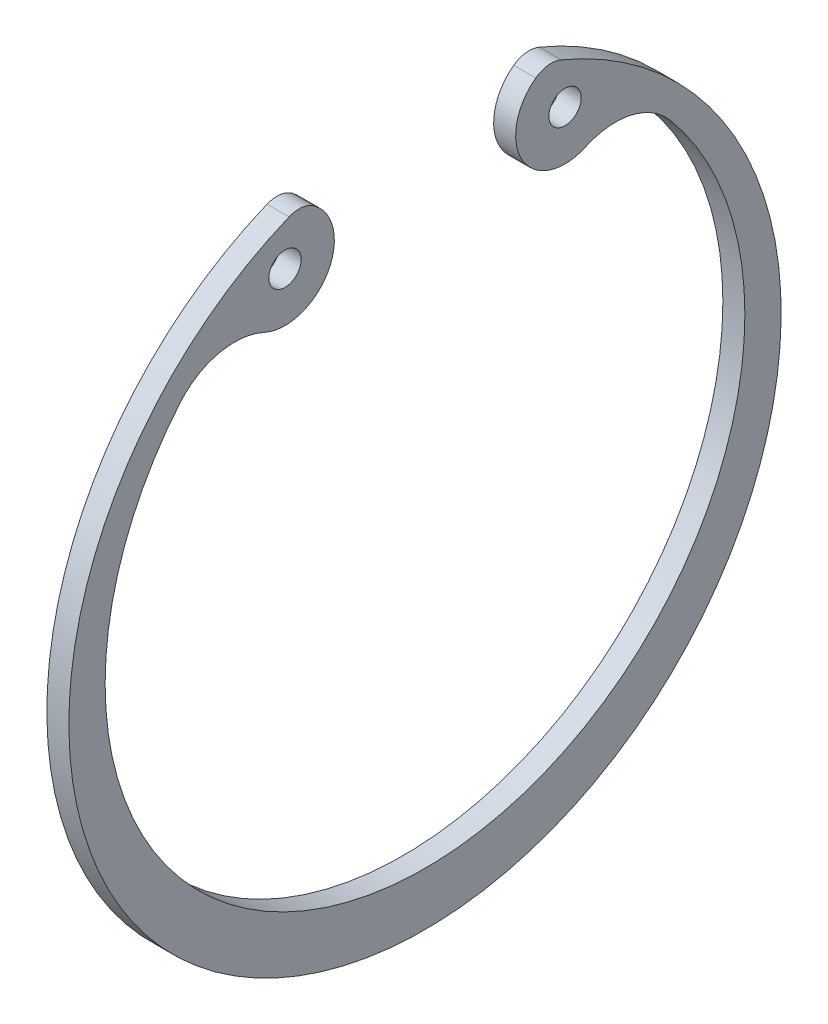
ISO-10303-21;
HEADER;
FILE_DESCRIPTION(('STEP AP214'),'2;1');
FILE_NAME('part.step','',(''),(''),'','','');
FILE_SCHEMA(('AUTOMOTIVE_DESIGN { 1 0 10303 214 1 1 1 1 }'));
ENDSEC;
DATA;
#1=APPLICATION_CONTEXT('core data for automotive mechanical design processes');
#2=APPLICATION_PROTOCOL_DEFINITION('international standard','automotive_design',2000,#1);
#3=PRODUCT_CONTEXT('',#1,'mechanical');
#4=PRODUCT('Part','Part','',(#3));
#5=PRODUCT_RELATED_PRODUCT_CATEGORY('part','',(#4));
#6=PRODUCT_DEFINITION_FORMATION('','',#4);
#7=PRODUCT_DEFINITION_CONTEXT('part definition',#1,'design');
#8=PRODUCT_DEFINITION('design','',#6,#7);
#9=PRODUCT_DEFINITION_SHAPE('','',#8);
#10=(LENGTH_UNIT() NAMED_UNIT(*) SI_UNIT(.MILLI.,.METRE.));
#11=(NAMED_UNIT(*) PLANE_ANGLE_UNIT() SI_UNIT($,.RADIAN.));
#12=(NAMED_UNIT(*) SI_UNIT($,.STERADIAN.) SOLID_ANGLE_UNIT());
#13=UNCERTAINTY_MEASURE_WITH_UNIT(LENGTH_MEASURE(1.E-05),#10,'distance_accuracy_value','');
#14=(GEOMETRIC_REPRESENTATION_CONTEXT(3) GLOBAL_UNCERTAINTY_ASSIGNED_CONTEXT((#13)) GLOBAL_UNIT_ASSIGNED_CONTEXT((#10,
#11,#12)) REPRESENTATION_CONTEXT('',''));
#15=CARTESIAN_POINT('',(0.,0.,0.));
#16=DIRECTION('',(0.,0.,1.));
#17=DIRECTION('',(1.,0.,0.));
#18=AXIS2_PLACEMENT_3D('',#15,#16,#17);
#19=CARTESIAN_POINT('',(1.7,11.7838280929559,4.86866465015439));
#20=DIRECTION('',(1.,0.,0.));
#21=DIRECTION('',(0.,0.,-1.));
#22=AXIS2_PLACEMENT_3D('',#19,#20,#21);
#23=PLANE('',#22);
#24=CARTESIAN_POINT('',(1.7,22.1092965197219,-10.8109055288764));
#25=DIRECTION('',(1.,0.,0.));
#26=DIRECTION('',(0.,0.,-1.));
#27=AXIS2_PLACEMENT_3D('',#24,#25,#26);
#28=CIRCLE('',#27,1.25);
#29=CARTESIAN_POINT('',(1.7,22.1092965197219,-12.0609055288764));
#30=VERTEX_POINT('',#29);
#31=EDGE_CURVE('E136',#30,#30,#28,.T.);
#32=ORIENTED_EDGE('',*,*,#31,.F.);
#33=EDGE_LOOP('',(#32));
#34=FACE_BOUND('',#33,.T.);
#35=CARTESIAN_POINT('',(1.7,23.5676561859118,9.73732930030878));
#36=DIRECTION('',(1.,0.,0.));
#37=DIRECTION('',(0.,0.,-1.));
#38=AXIS2_PLACEMENT_3D('',#35,#36,#37);
#39=CIRCLE('',#38,2.);
#40=CARTESIAN_POINT('',(1.7,25.1782975395719,8.5516504104401));
#41=VERTEX_POINT('',#40);
#42=CARTESIAN_POINT('',(1.7,25.4160998083363,10.5010414022938));
#43=VERTEX_POINT('',#42);
#44=EDGE_CURVE('E147',#41,#43,#39,.T.);
#45=ORIENTED_EDGE('',*,*,#44,.T.);
#46=CARTESIAN_POINT('',(1.7,0.,0.));
#47=DIRECTION('',(1.,0.,0.));
#48=DIRECTION('',(0.,0.,-1.));
#49=AXIS2_PLACEMENT_3D('',#46,#47,#48);
#50=CIRCLE('',#49,27.5);
#51=CARTESIAN_POINT('',(1.7,25.4160998083363,-10.5010414022938));
#52=VERTEX_POINT('',#51);
#53=EDGE_CURVE('E95',#43,#52,#50,.T.);
#54=ORIENTED_EDGE('',*,*,#53,.T.);
#55=CARTESIAN_POINT('',(1.7,23.5676561859118,-9.73732930030877));
#56=DIRECTION('',(1.,0.,0.));
#57=DIRECTION('',(0.,0.,1.));
#58=AXIS2_PLACEMENT_3D('',#55,#56,#57);
#59=CIRCLE('',#58,2.);
#60=CARTESIAN_POINT('',(1.7,25.1782975395718,-8.55165041044009));
#61=VERTEX_POINT('',#60);
#62=EDGE_CURVE('E162',#52,#61,#59,.T.);
#63=ORIENTED_EDGE('',*,*,#62,.T.);
#64=CARTESIAN_POINT('',(1.7,22.1092965197219,-10.8109055288764));
#65=DIRECTION('',(1.,0.,0.));
#66=DIRECTION('',(0.,0.,-1.));
#67=AXIS2_PLACEMENT_3D('',#64,#65,#66);
#68=CIRCLE('',#67,3.81090552887636);
#69=CARTESIAN_POINT('',(1.7,18.6469338912183,-12.4030883006591));
#70=VERTEX_POINT('',#69);
#71=EDGE_CURVE('E175',#61,#70,#68,.T.);
#72=ORIENTED_EDGE('',*,*,#71,.T.);
#73=CARTESIAN_POINT('',(1.7,13.6499602553001,-14.7009687331314));
#74=DIRECTION('',(-1.,0.,0.));
#75=DIRECTION('',(0.,0.,-1.));
#76=AXIS2_PLACEMENT_3D('',#73,#74,#75);
#77=CIRCLE('',#76,5.5);
#78=CARTESIAN_POINT('',(1.7,17.1877092867663,-18.9121837348097));
#79=VERTEX_POINT('',#78);
#80=EDGE_CURVE('E114',#70,#79,#77,.T.);
#81=ORIENTED_EDGE('',*,*,#80,.T.);
#82=CARTESIAN_POINT('',(1.7,1.3,0.));
#83=DIRECTION('',(-1.,0.,0.));
#84=DIRECTION('',(0.,0.,-1.));
#85=AXIS2_PLACEMENT_3D('',#82,#83,#84);
#86=CIRCLE('',#85,24.7);
#87=CARTESIAN_POINT('',(1.7,17.1877092867663,18.9121837348097));
#88=VERTEX_POINT('',#87);
#89=EDGE_CURVE('E108',#79,#88,#86,.T.);
#90=ORIENTED_EDGE('',*,*,#89,.T.);
#91=CARTESIAN_POINT('',(1.7,13.6499602553001,14.7009687331314));
#92=DIRECTION('',(-1.,0.,0.));
#93=DIRECTION('',(0.,0.,1.));
#94=AXIS2_PLACEMENT_3D('',#91,#92,#93);
#95=CIRCLE('',#94,5.5);
#96=CARTESIAN_POINT('',(1.7,18.6469338912183,12.4030883006591));
#97=VERTEX_POINT('',#96);
#98=EDGE_CURVE('E112',#88,#97,#95,.T.);
#99=ORIENTED_EDGE('',*,*,#98,.T.);
#100=CARTESIAN_POINT('',(1.7,22.1092965197219,10.8109055288764));
#101=DIRECTION('',(1.,0.,0.));
#102=DIRECTION('',(0.,0.,1.));
#103=AXIS2_PLACEMENT_3D('',#100,#101,#102);
#104=CIRCLE('',#103,3.81090552887636);
#105=EDGE_CURVE('E52',#97,#41,#104,.T.);
#106=ORIENTED_EDGE('',*,*,#105,.T.);
#107=EDGE_LOOP('',(#45,#54,#63,#72,#81,#90,#99,#106));
#108=FACE_BOUND('',#107,.T.);
#109=CARTESIAN_POINT('',(1.7,22.1092965197219,10.8109055288764));
#110=DIRECTION('',(1.,0.,0.));
#111=DIRECTION('',(0.,0.,1.));
#112=AXIS2_PLACEMENT_3D('',#109,#110,#111);
#113=CIRCLE('',#112,1.25);
#114=CARTESIAN_POINT('',(1.7,22.1092965197219,12.0609055288764));
#115=VERTEX_POINT('',#114);
#116=EDGE_CURVE('E184',#115,#115,#113,.T.);
#117=ORIENTED_EDGE('',*,*,#116,.F.);
#118=EDGE_LOOP('',(#117));
#119=FACE_BOUND('',#118,.T.);
#120=ADVANCED_FACE('F35',(#34,#108,#119),#23,.T.);
#121=CARTESIAN_POINT('',(0.,11.7838280929559,4.86866465015439));
#122=DIRECTION('',(1.,0.,0.));
#123=DIRECTION('',(0.,0.,-1.));
#124=AXIS2_PLACEMENT_3D('',#121,#122,#123);
#125=PLANE('',#124);
#126=CARTESIAN_POINT('',(0.,23.5676561859118,9.73732930030878));
#127=DIRECTION('',(1.,0.,0.));
#128=DIRECTION('',(0.,0.,-1.));
#129=AXIS2_PLACEMENT_3D('',#126,#127,#128);
#130=CIRCLE('',#129,2.);
#131=CARTESIAN_POINT('',(0.,25.1782975395719,8.5516504104401));
#132=VERTEX_POINT('',#131);
#133=CARTESIAN_POINT('',(0.,25.4160998083363,10.5010414022938));
#134=VERTEX_POINT('',#133);
#135=EDGE_CURVE('E132',#132,#134,#130,.T.);
#136=ORIENTED_EDGE('',*,*,#135,.F.);
#137=CARTESIAN_POINT('',(0.,22.1092965197219,10.8109055288764));
#138=DIRECTION('',(1.,0.,0.));
#139=DIRECTION('',(0.,0.,1.));
#140=AXIS2_PLACEMENT_3D('',#137,#138,#139);
#141=CIRCLE('',#140,3.81090552887636);
#142=CARTESIAN_POINT('',(0.,18.6469338912183,12.4030883006591));
#143=VERTEX_POINT('',#142);
#144=EDGE_CURVE('E87',#143,#132,#141,.T.);
#145=ORIENTED_EDGE('',*,*,#144,.F.);
#146=CARTESIAN_POINT('',(0.,13.6499602553001,14.7009687331314));
#147=DIRECTION('',(-1.,0.,0.));
#148=DIRECTION('',(0.,0.,1.));
#149=AXIS2_PLACEMENT_3D('',#146,#147,#148);
#150=CIRCLE('',#149,5.5);
#151=CARTESIAN_POINT('',(0.,17.1877092867663,18.9121837348097));
#152=VERTEX_POINT('',#151);
#153=EDGE_CURVE('E81',#152,#143,#150,.T.);
#154=ORIENTED_EDGE('',*,*,#153,.F.);
#155=CARTESIAN_POINT('',(0.,1.3,0.));
#156=DIRECTION('',(-1.,0.,0.));
#157=DIRECTION('',(0.,0.,-1.));
#158=AXIS2_PLACEMENT_3D('',#155,#156,#157);
#159=CIRCLE('',#158,24.7);
#160=CARTESIAN_POINT('',(0.,17.1877092867663,-18.9121837348097));
#161=VERTEX_POINT('',#160);
#162=EDGE_CURVE('E122',#161,#152,#159,.T.);
#163=ORIENTED_EDGE('',*,*,#162,.F.);
#164=CARTESIAN_POINT('',(0.,13.6499602553001,-14.7009687331314));
#165=DIRECTION('',(-1.,0.,0.));
#166=DIRECTION('',(0.,0.,-1.));
#167=AXIS2_PLACEMENT_3D('',#164,#165,#166);
#168=CIRCLE('',#167,5.5);
#169=CARTESIAN_POINT('',(0.,18.6469338912183,-12.4030883006591));
#170=VERTEX_POINT('',#169);
#171=EDGE_CURVE('E142',#170,#161,#168,.T.);
#172=ORIENTED_EDGE('',*,*,#171,.F.);
#173=CARTESIAN_POINT('',(0.,22.1092965197219,-10.8109055288764));
#174=DIRECTION('',(1.,0.,0.));
#175=DIRECTION('',(0.,0.,-1.));
#176=AXIS2_PLACEMENT_3D('',#173,#174,#175);
#177=CIRCLE('',#176,3.81090552887636);
#178=CARTESIAN_POINT('',(0.,25.1782975395718,-8.55165041044009));
#179=VERTEX_POINT('',#178);
#180=EDGE_CURVE('E140',#179,#170,#177,.T.);
#181=ORIENTED_EDGE('',*,*,#180,.F.);
#182=CARTESIAN_POINT('',(0.,23.5676561859118,-9.73732930030877));
#183=DIRECTION('',(1.,0.,0.));
#184=DIRECTION('',(0.,0.,1.));
#185=AXIS2_PLACEMENT_3D('',#182,#183,#184);
#186=CIRCLE('',#185,2.);
#187=CARTESIAN_POINT('',(0.,25.4160998083363,-10.5010414022938));
#188=VERTEX_POINT('',#187);
#189=EDGE_CURVE('E138',#188,#179,#186,.T.);
#190=ORIENTED_EDGE('',*,*,#189,.F.);
#191=CARTESIAN_POINT('',(0.,0.,0.));
#192=DIRECTION('',(1.,0.,0.));
#193=DIRECTION('',(0.,0.,-1.));
#194=AXIS2_PLACEMENT_3D('',#191,#192,#193);
#195=CIRCLE('',#194,27.5);
#196=EDGE_CURVE('E135',#134,#188,#195,.T.);
#197=ORIENTED_EDGE('',*,*,#196,.F.);
#198=EDGE_LOOP('',(#136,#145,#154,#163,#172,#181,#190,#197));
#199=FACE_BOUND('',#198,.T.);
#200=CARTESIAN_POINT('',(0.,22.1092965197219,-10.8109055288764));
#201=DIRECTION('',(1.,0.,0.));
#202=DIRECTION('',(0.,0.,-1.));
#203=AXIS2_PLACEMENT_3D('',#200,#201,#202);
#204=CIRCLE('',#203,1.25);
#205=CARTESIAN_POINT('',(0.,22.1092965197219,-12.0609055288764));
#206=VERTEX_POINT('',#205);
#207=EDGE_CURVE('E181',#206,#206,#204,.T.);
#208=ORIENTED_EDGE('',*,*,#207,.T.);
#209=EDGE_LOOP('',(#208));
#210=FACE_BOUND('',#209,.T.);
#211=CARTESIAN_POINT('',(0.,22.1092965197219,10.8109055288764));
#212=DIRECTION('',(1.,0.,0.));
#213=DIRECTION('',(0.,0.,1.));
#214=AXIS2_PLACEMENT_3D('',#211,#212,#213);
#215=CIRCLE('',#214,1.25);
#216=CARTESIAN_POINT('',(0.,22.1092965197219,12.0609055288764));
#217=VERTEX_POINT('',#216);
#218=EDGE_CURVE('E187',#217,#217,#215,.T.);
#219=ORIENTED_EDGE('',*,*,#218,.T.);
#220=EDGE_LOOP('',(#219));
#221=FACE_BOUND('',#220,.T.);
#222=ADVANCED_FACE('F166',(#199,#210,#221),#125,.F.);
#223=CARTESIAN_POINT('',(1.7,23.5676561859118,9.73732930030878));
#224=DIRECTION('',(-1.,0.,0.));
#225=DIRECTION('',(0.,0.,1.));
#226=AXIS2_PLACEMENT_3D('',#223,#224,#225);
#227=CYLINDRICAL_SURFACE('',#226,2.);
#228=ORIENTED_EDGE('',*,*,#135,.T.);
#229=DIRECTION('',(-1.,0.,0.));
#230=VECTOR('',#229,1.);
#231=CARTESIAN_POINT('',(1.7,25.4160998083363,10.5010414022938));
#232=LINE('',#231,#230);
#233=EDGE_CURVE('E11',#43,#134,#232,.T.);
#234=ORIENTED_EDGE('',*,*,#233,.F.);
#235=ORIENTED_EDGE('',*,*,#44,.F.);
#236=DIRECTION('',(-1.,0.,0.));
#237=VECTOR('',#236,1.);
#238=CARTESIAN_POINT('',(1.7,25.1782975395719,8.5516504104401));
#239=LINE('',#238,#237);
#240=EDGE_CURVE('E128',#41,#132,#239,.T.);
#241=ORIENTED_EDGE('',*,*,#240,.T.);
#242=EDGE_LOOP('',(#228,#234,#235,#241));
#243=FACE_BOUND('',#242,.T.);
#244=ADVANCED_FACE('F37',(#243),#227,.T.);
#245=CARTESIAN_POINT('',(1.7,0.,0.));
#246=DIRECTION('',(-1.,0.,0.));
#247=DIRECTION('',(0.,0.,1.));
#248=AXIS2_PLACEMENT_3D('',#245,#246,#247);
#249=CYLINDRICAL_SURFACE('',#248,27.5);
#250=ORIENTED_EDGE('',*,*,#196,.T.);
#251=DIRECTION('',(-1.,0.,0.));
#252=VECTOR('',#251,1.);
#253=CARTESIAN_POINT('',(1.7,25.4160998083363,-10.5010414022938));
#254=LINE('',#253,#252);
#255=EDGE_CURVE('E44',#52,#188,#254,.T.);
#256=ORIENTED_EDGE('',*,*,#255,.F.);
#257=ORIENTED_EDGE('',*,*,#53,.F.);
#258=ORIENTED_EDGE('',*,*,#233,.T.);
#259=EDGE_LOOP('',(#250,#256,#257,#258));
#260=FACE_BOUND('',#259,.T.);
#261=ADVANCED_FACE('F219',(#260),#249,.T.);
#262=CARTESIAN_POINT('',(1.7,23.5676561859118,-9.73732930030877));
#263=DIRECTION('',(-1.,0.,0.));
#264=DIRECTION('',(0.,0.,1.));
#265=AXIS2_PLACEMENT_3D('',#262,#263,#264);
#266=CYLINDRICAL_SURFACE('',#265,2.);
#267=ORIENTED_EDGE('',*,*,#189,.T.);
#268=DIRECTION('',(-1.,0.,0.));
#269=VECTOR('',#268,1.);
#270=CARTESIAN_POINT('',(1.7,25.1782975395718,-8.55165041044009));
#271=LINE('',#270,#269);
#272=EDGE_CURVE('E154',#61,#179,#271,.T.);
#273=ORIENTED_EDGE('',*,*,#272,.F.);
#274=ORIENTED_EDGE('',*,*,#62,.F.);
#275=ORIENTED_EDGE('',*,*,#255,.T.);
#276=EDGE_LOOP('',(#267,#273,#274,#275));
#277=FACE_BOUND('',#276,.T.);
#278=ADVANCED_FACE('F160',(#277),#266,.T.);
#279=CARTESIAN_POINT('',(1.7,22.1092965197219,-10.8109055288764));
#280=DIRECTION('',(-1.,0.,0.));
#281=DIRECTION('',(0.,0.,1.));
#282=AXIS2_PLACEMENT_3D('',#279,#280,#281);
#283=CYLINDRICAL_SURFACE('',#282,3.81090552887636);
#284=ORIENTED_EDGE('',*,*,#180,.T.);
#285=DIRECTION('',(-1.,0.,0.));
#286=VECTOR('',#285,1.);
#287=CARTESIAN_POINT('',(1.7,18.6469338912183,-12.4030883006591));
#288=LINE('',#287,#286);
#289=EDGE_CURVE('E151',#70,#170,#288,.T.);
#290=ORIENTED_EDGE('',*,*,#289,.F.);
#291=ORIENTED_EDGE('',*,*,#71,.F.);
#292=ORIENTED_EDGE('',*,*,#272,.T.);
#293=EDGE_LOOP('',(#284,#290,#291,#292));
#294=FACE_BOUND('',#293,.T.);
#295=ADVANCED_FACE('F171',(#294),#283,.T.);
#296=CARTESIAN_POINT('',(1.7,13.6499602553001,-14.7009687331314));
#297=DIRECTION('',(-1.,0.,0.));
#298=DIRECTION('',(0.,0.,1.));
#299=AXIS2_PLACEMENT_3D('',#296,#297,#298);
#300=CYLINDRICAL_SURFACE('',#299,5.5);
#301=ORIENTED_EDGE('',*,*,#171,.T.);
#302=DIRECTION('',(-1.,0.,0.));
#303=VECTOR('',#302,1.);
#304=CARTESIAN_POINT('',(1.7,17.1877092867663,-18.9121837348097));
#305=LINE('',#304,#303);
#306=EDGE_CURVE('E123',#79,#161,#305,.T.);
#307=ORIENTED_EDGE('',*,*,#306,.F.);
#308=ORIENTED_EDGE('',*,*,#80,.F.);
#309=ORIENTED_EDGE('',*,*,#289,.T.);
#310=EDGE_LOOP('',(#301,#307,#308,#309));
#311=FACE_BOUND('',#310,.T.);
#312=ADVANCED_FACE('F174',(#311),#300,.F.);
#313=CARTESIAN_POINT('',(1.7,1.3,0.));
#314=DIRECTION('',(-1.,0.,0.));
#315=DIRECTION('',(0.,0.,1.));
#316=AXIS2_PLACEMENT_3D('',#313,#314,#315);
#317=CYLINDRICAL_SURFACE('',#316,24.7);
#318=ORIENTED_EDGE('',*,*,#162,.T.);
#319=DIRECTION('',(-1.,0.,0.));
#320=VECTOR('',#319,1.);
#321=CARTESIAN_POINT('',(1.7,17.1877092867663,18.9121837348097));
#322=LINE('',#321,#320);
#323=EDGE_CURVE('E119',#88,#152,#322,.T.);
#324=ORIENTED_EDGE('',*,*,#323,.F.);
#325=ORIENTED_EDGE('',*,*,#89,.F.);
#326=ORIENTED_EDGE('',*,*,#306,.T.);
#327=EDGE_LOOP('',(#318,#324,#325,#326));
#328=FACE_BOUND('',#327,.T.);
#329=ADVANCED_FACE('F120',(#328),#317,.F.);
#330=CARTESIAN_POINT('',(1.7,13.6499602553001,14.7009687331314));
#331=DIRECTION('',(-1.,0.,0.));
#332=DIRECTION('',(0.,0.,1.));
#333=AXIS2_PLACEMENT_3D('',#330,#331,#332);
#334=CYLINDRICAL_SURFACE('',#333,5.5);
#335=ORIENTED_EDGE('',*,*,#153,.T.);
#336=DIRECTION('',(-1.,0.,0.));
#337=VECTOR('',#336,1.);
#338=CARTESIAN_POINT('',(1.7,18.6469338912183,12.4030883006591));
#339=LINE('',#338,#337);
#340=EDGE_CURVE('E124',#97,#143,#339,.T.);
#341=ORIENTED_EDGE('',*,*,#340,.F.);
#342=ORIENTED_EDGE('',*,*,#98,.F.);
#343=ORIENTED_EDGE('',*,*,#323,.T.);
#344=EDGE_LOOP('',(#335,#341,#342,#343));
#345=FACE_BOUND('',#344,.T.);
#346=ADVANCED_FACE('F126',(#345),#334,.F.);
#347=CARTESIAN_POINT('',(1.7,22.1092965197219,10.8109055288764));
#348=DIRECTION('',(-1.,0.,0.));
#349=DIRECTION('',(0.,0.,1.));
#350=AXIS2_PLACEMENT_3D('',#347,#348,#349);
#351=CYLINDRICAL_SURFACE('',#350,3.81090552887636);
#352=ORIENTED_EDGE('',*,*,#144,.T.);
#353=ORIENTED_EDGE('',*,*,#240,.F.);
#354=ORIENTED_EDGE('',*,*,#105,.F.);
#355=ORIENTED_EDGE('',*,*,#340,.T.);
#356=EDGE_LOOP('',(#352,#353,#354,#355));
#357=FACE_BOUND('',#356,.T.);
#358=ADVANCED_FACE('F207',(#357),#351,.T.);
#359=CARTESIAN_POINT('',(1.7,22.1092965197219,-10.8109055288764));
#360=DIRECTION('',(-1.,0.,0.));
#361=DIRECTION('',(0.,0.,1.));
#362=AXIS2_PLACEMENT_3D('',#359,#360,#361);
#363=CYLINDRICAL_SURFACE('',#362,1.25);
#364=ORIENTED_EDGE('',*,*,#31,.T.);
#365=EDGE_LOOP('',(#364));
#366=FACE_BOUND('',#365,.T.);
#367=ORIENTED_EDGE('',*,*,#207,.F.);
#368=EDGE_LOOP('',(#367));
#369=FACE_BOUND('',#368,.T.);
#370=ADVANCED_FACE('F204',(#366,#369),#363,.F.);
#371=CARTESIAN_POINT('',(1.7,22.1092965197219,10.8109055288764));
#372=DIRECTION('',(-1.,0.,0.));
#373=DIRECTION('',(0.,0.,1.));
#374=AXIS2_PLACEMENT_3D('',#371,#372,#373);
#375=CYLINDRICAL_SURFACE('',#374,1.25);
#376=ORIENTED_EDGE('',*,*,#116,.T.);
#377=EDGE_LOOP('',(#376));
#378=FACE_BOUND('',#377,.T.);
#379=ORIENTED_EDGE('',*,*,#218,.F.);
#380=EDGE_LOOP('',(#379));
#381=FACE_BOUND('',#380,.T.);
#382=ADVANCED_FACE('F193',(#378,#381),#375,.F.);
#383=CLOSED_SHELL('',(#120,#222,#244,#261,#278,#295,#312,#329,#346,#358,#370,#382));
#384=MANIFOLD_SOLID_BREP('B2',#383);
#385=ADVANCED_BREP_SHAPE_REPRESENTATION('',(#18,#384),#14);
#386=SHAPE_DEFINITION_REPRESENTATION(#9,#385);
ENDSEC;
END-ISO-10303-21;
